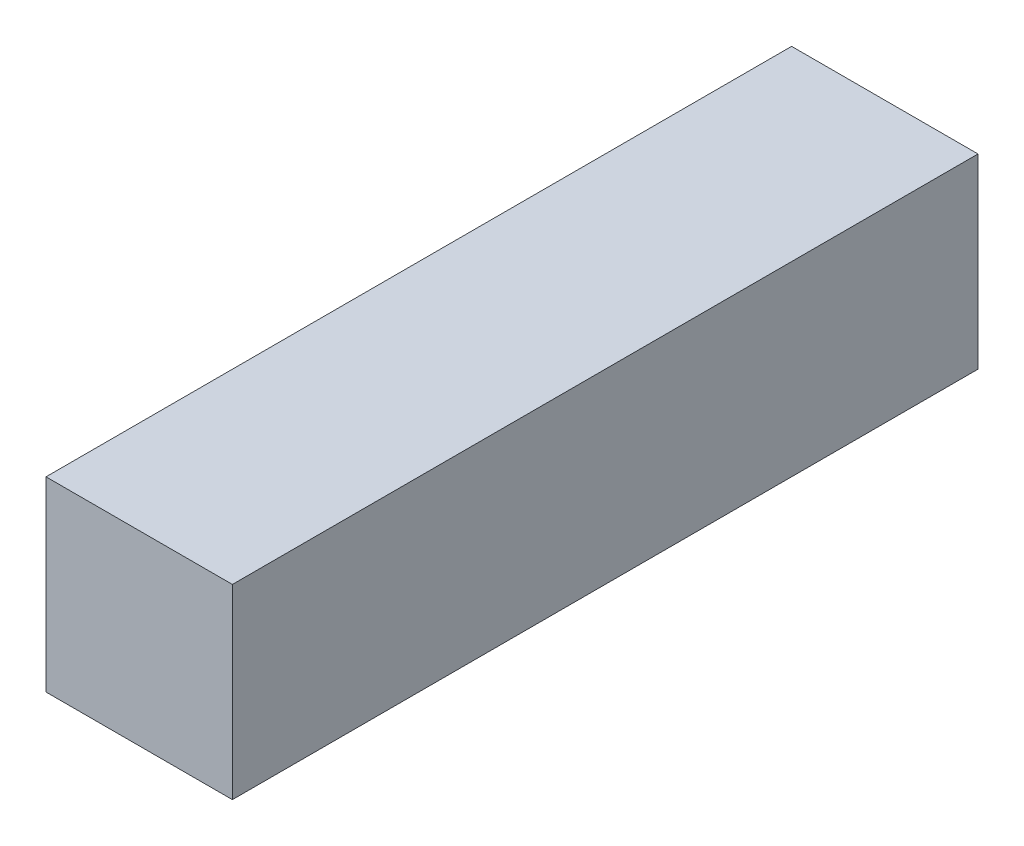
ISO-10303-21;
HEADER;
FILE_DESCRIPTION(('STEP AP214'),'2;1');
FILE_NAME('part.step','',(''),(''),'','','');
FILE_SCHEMA(('AUTOMOTIVE_DESIGN { 1 0 10303 214 1 1 1 1 }'));
ENDSEC;
DATA;
#1=APPLICATION_CONTEXT('core data for automotive mechanical design processes');
#2=APPLICATION_PROTOCOL_DEFINITION('international standard','automotive_design',2000,#1);
#3=PRODUCT_CONTEXT('',#1,'mechanical');
#4=PRODUCT('Part','Part','',(#3));
#5=PRODUCT_RELATED_PRODUCT_CATEGORY('part','',(#4));
#6=PRODUCT_DEFINITION_FORMATION('','',#4);
#7=PRODUCT_DEFINITION_CONTEXT('part definition',#1,'design');
#8=PRODUCT_DEFINITION('design','',#6,#7);
#9=PRODUCT_DEFINITION_SHAPE('','',#8);
#10=(LENGTH_UNIT() NAMED_UNIT(*) SI_UNIT(.MILLI.,.METRE.));
#11=(NAMED_UNIT(*) PLANE_ANGLE_UNIT() SI_UNIT($,.RADIAN.));
#12=(NAMED_UNIT(*) SI_UNIT($,.STERADIAN.) SOLID_ANGLE_UNIT());
#13=UNCERTAINTY_MEASURE_WITH_UNIT(LENGTH_MEASURE(1.E-05),#10,'distance_accuracy_value','');
#14=(GEOMETRIC_REPRESENTATION_CONTEXT(3) GLOBAL_UNCERTAINTY_ASSIGNED_CONTEXT((#13)) GLOBAL_UNIT_ASSIGNED_CONTEXT((#10,
#11,#12)) REPRESENTATION_CONTEXT('',''));
#15=CARTESIAN_POINT('',(0.,0.,0.));
#16=DIRECTION('',(0.,0.,1.));
#17=DIRECTION('',(1.,0.,0.));
#18=AXIS2_PLACEMENT_3D('',#15,#16,#17);
#19=CARTESIAN_POINT('',(0.,0.,12.));
#20=DIRECTION('',(1.,0.,0.));
#21=DIRECTION('',(0.,1.,0.));
#22=AXIS2_PLACEMENT_3D('',#19,#20,#21);
#23=PLANE('',#22);
#24=DIRECTION('',(0.,-1.,0.));
#25=VECTOR('',#24,1.);
#26=CARTESIAN_POINT('',(0.,0.,0.));
#27=LINE('',#26,#25);
#28=CARTESIAN_POINT('',(0.,0.,0.));
#29=VERTEX_POINT('',#28);
#30=CARTESIAN_POINT('',(0.,-3.,0.));
#31=VERTEX_POINT('',#30);
#32=EDGE_CURVE('E96',#29,#31,#27,.T.);
#33=ORIENTED_EDGE('',*,*,#32,.T.);
#34=DIRECTION('',(0.,0.,-1.));
#35=VECTOR('',#34,1.);
#36=CARTESIAN_POINT('',(0.,-3.,12.));
#37=LINE('',#36,#35);
#38=CARTESIAN_POINT('',(0.,-3.,12.));
#39=VERTEX_POINT('',#38);
#40=EDGE_CURVE('E11',#39,#31,#37,.T.);
#41=ORIENTED_EDGE('',*,*,#40,.F.);
#42=DIRECTION('',(0.,-1.,0.));
#43=VECTOR('',#42,1.);
#44=CARTESIAN_POINT('',(0.,0.,12.));
#45=LINE('',#44,#43);
#46=CARTESIAN_POINT('',(0.,0.,12.));
#47=VERTEX_POINT('',#46);
#48=EDGE_CURVE('E84',#47,#39,#45,.T.);
#49=ORIENTED_EDGE('',*,*,#48,.F.);
#50=DIRECTION('',(0.,0.,-1.));
#51=VECTOR('',#50,1.);
#52=CARTESIAN_POINT('',(0.,0.,12.));
#53=LINE('',#52,#51);
#54=EDGE_CURVE('E92',#47,#29,#53,.T.);
#55=ORIENTED_EDGE('',*,*,#54,.T.);
#56=EDGE_LOOP('',(#33,#41,#49,#55));
#57=FACE_BOUND('',#56,.T.);
#58=ADVANCED_FACE('F33',(#57),#23,.F.);
#59=CARTESIAN_POINT('',(0.,-3.,12.));
#60=DIRECTION('',(0.,1.,0.));
#61=DIRECTION('',(0.,0.,1.));
#62=AXIS2_PLACEMENT_3D('',#59,#60,#61);
#63=PLANE('',#62);
#64=DIRECTION('',(1.,0.,0.));
#65=VECTOR('',#64,1.);
#66=CARTESIAN_POINT('',(0.,-3.,0.));
#67=LINE('',#66,#65);
#68=CARTESIAN_POINT('',(3.,-3.,0.));
#69=VERTEX_POINT('',#68);
#70=EDGE_CURVE('E88',#31,#69,#67,.T.);
#71=ORIENTED_EDGE('',*,*,#70,.T.);
#72=DIRECTION('',(0.,0.,-1.));
#73=VECTOR('',#72,1.);
#74=CARTESIAN_POINT('',(3.,-3.,12.));
#75=LINE('',#74,#73);
#76=CARTESIAN_POINT('',(3.,-3.,12.));
#77=VERTEX_POINT('',#76);
#78=EDGE_CURVE('E41',#77,#69,#75,.T.);
#79=ORIENTED_EDGE('',*,*,#78,.F.);
#80=DIRECTION('',(1.,0.,0.));
#81=VECTOR('',#80,1.);
#82=CARTESIAN_POINT('',(0.,-3.,12.));
#83=LINE('',#82,#81);
#84=EDGE_CURVE('E79',#39,#77,#83,.T.);
#85=ORIENTED_EDGE('',*,*,#84,.F.);
#86=ORIENTED_EDGE('',*,*,#40,.T.);
#87=EDGE_LOOP('',(#71,#79,#85,#86));
#88=FACE_BOUND('',#87,.T.);
#89=ADVANCED_FACE('F87',(#88),#63,.F.);
#90=CARTESIAN_POINT('',(3.,0.,12.));
#91=DIRECTION('',(-1.,0.,0.));
#92=DIRECTION('',(0.,-1.,0.));
#93=AXIS2_PLACEMENT_3D('',#90,#91,#92);
#94=PLANE('',#93);
#95=DIRECTION('',(0.,1.,0.));
#96=VECTOR('',#95,1.);
#97=CARTESIAN_POINT('',(3.,0.,0.));
#98=LINE('',#97,#96);
#99=CARTESIAN_POINT('',(3.,0.,0.));
#100=VERTEX_POINT('',#99);
#101=EDGE_CURVE('E66',#69,#100,#98,.T.);
#102=ORIENTED_EDGE('',*,*,#101,.T.);
#103=DIRECTION('',(0.,0.,-1.));
#104=VECTOR('',#103,1.);
#105=CARTESIAN_POINT('',(3.,0.,12.));
#106=LINE('',#105,#104);
#107=CARTESIAN_POINT('',(3.,0.,12.));
#108=VERTEX_POINT('',#107);
#109=EDGE_CURVE('E89',#108,#100,#106,.T.);
#110=ORIENTED_EDGE('',*,*,#109,.F.);
#111=DIRECTION('',(0.,1.,0.));
#112=VECTOR('',#111,1.);
#113=CARTESIAN_POINT('',(3.,0.,12.));
#114=LINE('',#113,#112);
#115=EDGE_CURVE('E82',#77,#108,#114,.T.);
#116=ORIENTED_EDGE('',*,*,#115,.F.);
#117=ORIENTED_EDGE('',*,*,#78,.T.);
#118=EDGE_LOOP('',(#102,#110,#116,#117));
#119=FACE_BOUND('',#118,.T.);
#120=ADVANCED_FACE('F90',(#119),#94,.F.);
#121=CARTESIAN_POINT('',(0.,0.,12.));
#122=DIRECTION('',(0.,-1.,0.));
#123=DIRECTION('',(0.,0.,-1.));
#124=AXIS2_PLACEMENT_3D('',#121,#122,#123);
#125=PLANE('',#124);
#126=DIRECTION('',(-1.,0.,0.));
#127=VECTOR('',#126,1.);
#128=CARTESIAN_POINT('',(0.,0.,0.));
#129=LINE('',#128,#127);
#130=EDGE_CURVE('E72',#100,#29,#129,.T.);
#131=ORIENTED_EDGE('',*,*,#130,.T.);
#132=ORIENTED_EDGE('',*,*,#54,.F.);
#133=DIRECTION('',(-1.,0.,0.));
#134=VECTOR('',#133,1.);
#135=CARTESIAN_POINT('',(0.,0.,12.));
#136=LINE('',#135,#134);
#137=EDGE_CURVE('E49',#108,#47,#136,.T.);
#138=ORIENTED_EDGE('',*,*,#137,.F.);
#139=ORIENTED_EDGE('',*,*,#109,.T.);
#140=EDGE_LOOP('',(#131,#132,#138,#139));
#141=FACE_BOUND('',#140,.T.);
#142=ADVANCED_FACE('F103',(#141),#125,.F.);
#143=CARTESIAN_POINT('',(0.,0.,12.));
#144=DIRECTION('',(0.,0.,1.));
#145=DIRECTION('',(1.,0.,0.));
#146=AXIS2_PLACEMENT_3D('',#143,#144,#145);
#147=PLANE('',#146);
#148=ORIENTED_EDGE('',*,*,#48,.T.);
#149=ORIENTED_EDGE('',*,*,#84,.T.);
#150=ORIENTED_EDGE('',*,*,#115,.T.);
#151=ORIENTED_EDGE('',*,*,#137,.T.);
#152=EDGE_LOOP('',(#148,#149,#150,#151));
#153=FACE_BOUND('',#152,.T.);
#154=ADVANCED_FACE('F80',(#153),#147,.T.);
#155=CARTESIAN_POINT('',(0.,0.,0.));
#156=DIRECTION('',(0.,0.,1.));
#157=DIRECTION('',(1.,0.,0.));
#158=AXIS2_PLACEMENT_3D('',#155,#156,#157);
#159=PLANE('',#158);
#160=ORIENTED_EDGE('',*,*,#32,.F.);
#161=ORIENTED_EDGE('',*,*,#130,.F.);
#162=ORIENTED_EDGE('',*,*,#101,.F.);
#163=ORIENTED_EDGE('',*,*,#70,.F.);
#164=EDGE_LOOP('',(#160,#161,#162,#163));
#165=FACE_BOUND('',#164,.T.);
#166=ADVANCED_FACE('F106',(#165),#159,.F.);
#167=CLOSED_SHELL('',(#58,#89,#120,#142,#154,#166));
#168=MANIFOLD_SOLID_BREP('B2',#167);
#169=ADVANCED_BREP_SHAPE_REPRESENTATION('',(#18,#168),#14);
#170=SHAPE_DEFINITION_REPRESENTATION(#9,#169);
ENDSEC;
END-ISO-10303-21;
